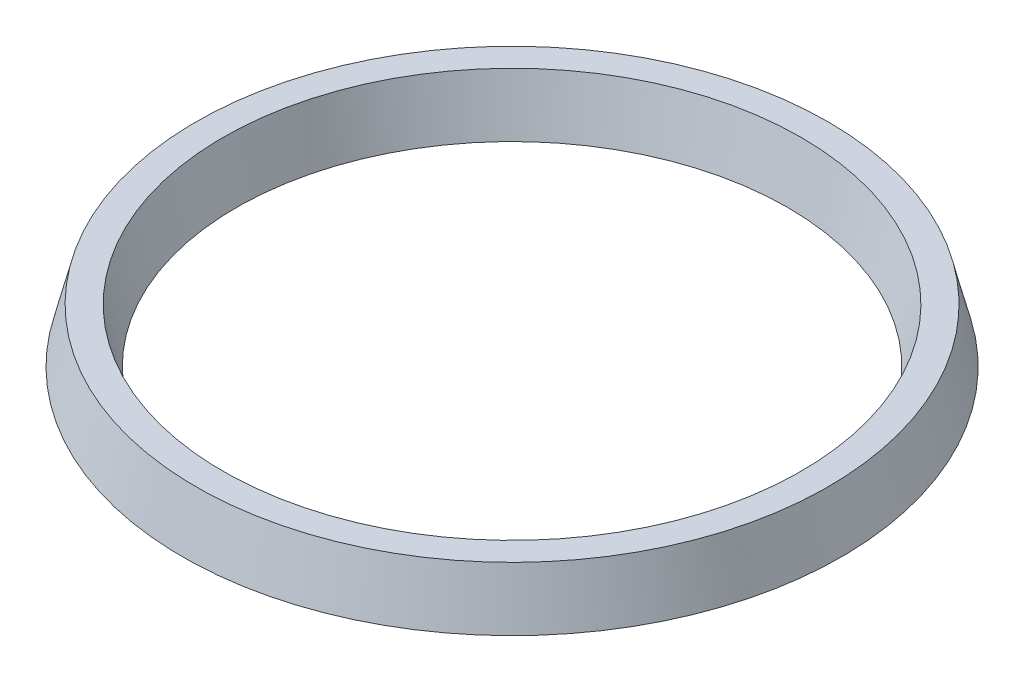
ISO-10303-21;
HEADER;
FILE_DESCRIPTION(('STEP AP214'),'2;1');
FILE_NAME('part.step','',(''),(''),'','','');
FILE_SCHEMA(('AUTOMOTIVE_DESIGN { 1 0 10303 214 1 1 1 1 }'));
ENDSEC;
DATA;
#1=APPLICATION_CONTEXT('core data for automotive mechanical design processes');
#2=APPLICATION_PROTOCOL_DEFINITION('international standard','automotive_design',2000,#1);
#3=PRODUCT_CONTEXT('',#1,'mechanical');
#4=PRODUCT('Part','Part','',(#3));
#5=PRODUCT_RELATED_PRODUCT_CATEGORY('part','',(#4));
#6=PRODUCT_DEFINITION_FORMATION('','',#4);
#7=PRODUCT_DEFINITION_CONTEXT('part definition',#1,'design');
#8=PRODUCT_DEFINITION('design','',#6,#7);
#9=PRODUCT_DEFINITION_SHAPE('','',#8);
#10=(LENGTH_UNIT() NAMED_UNIT(*) SI_UNIT(.MILLI.,.METRE.));
#11=(NAMED_UNIT(*) PLANE_ANGLE_UNIT() SI_UNIT($,.RADIAN.));
#12=(NAMED_UNIT(*) SI_UNIT($,.STERADIAN.) SOLID_ANGLE_UNIT());
#13=UNCERTAINTY_MEASURE_WITH_UNIT(LENGTH_MEASURE(1.E-05),#10,'distance_accuracy_value','');
#14=(GEOMETRIC_REPRESENTATION_CONTEXT(3) GLOBAL_UNCERTAINTY_ASSIGNED_CONTEXT((#13)) GLOBAL_UNIT_ASSIGNED_CONTEXT((#10,
#11,#12)) REPRESENTATION_CONTEXT('',''));
#15=CARTESIAN_POINT('',(0.,0.,0.));
#16=DIRECTION('',(0.,0.,1.));
#17=DIRECTION('',(1.,0.,0.));
#18=AXIS2_PLACEMENT_3D('',#15,#16,#17);
#19=CARTESIAN_POINT('',(0.,6.00000000000001,0.));
#20=DIRECTION('',(0.,1.,0.));
#21=DIRECTION('',(0.,0.,1.));
#22=AXIS2_PLACEMENT_3D('',#19,#20,#21);
#23=CONICAL_SURFACE('',#22,64.31,0.244978663126864);
#24=CARTESIAN_POINT('',(0.,-5.99999999999999,0.));
#25=DIRECTION('',(0.,-1.,0.));
#26=DIRECTION('',(0.,0.,-1.));
#27=AXIS2_PLACEMENT_3D('',#24,#25,#26);
#28=CIRCLE('',#27,61.31);
#29=CARTESIAN_POINT('',(0.,-5.99999999999999,-61.31));
#30=VERTEX_POINT('',#29);
#31=EDGE_CURVE('E59',#30,#30,#28,.T.);
#32=ORIENTED_EDGE('',*,*,#31,.T.);
#33=EDGE_LOOP('',(#32));
#34=FACE_BOUND('',#33,.T.);
#35=CARTESIAN_POINT('',(0.,6.00000000000001,0.));
#36=DIRECTION('',(0.,-1.,0.));
#37=DIRECTION('',(0.,0.,-1.));
#38=AXIS2_PLACEMENT_3D('',#35,#36,#37);
#39=CIRCLE('',#38,64.31);
#40=CARTESIAN_POINT('',(0.,6.00000000000001,-64.31));
#41=VERTEX_POINT('',#40);
#42=EDGE_CURVE('E10',#41,#41,#39,.T.);
#43=ORIENTED_EDGE('',*,*,#42,.F.);
#44=EDGE_LOOP('',(#43));
#45=FACE_BOUND('',#44,.T.);
#46=ADVANCED_FACE('F31',(#34,#45),#23,.F.);
#47=CARTESIAN_POINT('',(0.,6.00000000000001,-64.31));
#48=DIRECTION('',(0.,1.,0.));
#49=DIRECTION('',(0.,0.,1.));
#50=AXIS2_PLACEMENT_3D('',#47,#48,#49);
#51=PLANE('',#50);
#52=ORIENTED_EDGE('',*,*,#42,.T.);
#53=EDGE_LOOP('',(#52));
#54=FACE_BOUND('',#53,.T.);
#55=CARTESIAN_POINT('',(0.,6.00000000000001,0.));
#56=DIRECTION('',(0.,-1.,0.));
#57=DIRECTION('',(0.,0.,-1.));
#58=AXIS2_PLACEMENT_3D('',#55,#56,#57);
#59=CIRCLE('',#58,70.31);
#60=CARTESIAN_POINT('',(0.,6.00000000000001,-70.31));
#61=VERTEX_POINT('',#60);
#62=EDGE_CURVE('E37',#61,#61,#59,.T.);
#63=ORIENTED_EDGE('',*,*,#62,.F.);
#64=EDGE_LOOP('',(#63));
#65=FACE_BOUND('',#64,.T.);
#66=ADVANCED_FACE('F77',(#54,#65),#51,.T.);
#67=CARTESIAN_POINT('',(0.,-5.99999999999999,0.));
#68=DIRECTION('',(0.,-1.,0.));
#69=DIRECTION('',(0.,0.,-1.));
#70=AXIS2_PLACEMENT_3D('',#67,#68,#69);
#71=CONICAL_SURFACE('',#70,73.31,0.244978663126864);
#72=ORIENTED_EDGE('',*,*,#62,.T.);
#73=EDGE_LOOP('',(#72));
#74=FACE_BOUND('',#73,.T.);
#75=CARTESIAN_POINT('',(0.,-5.99999999999999,0.));
#76=DIRECTION('',(0.,-1.,0.));
#77=DIRECTION('',(0.,0.,-1.));
#78=AXIS2_PLACEMENT_3D('',#75,#76,#77);
#79=CIRCLE('',#78,73.31);
#80=CARTESIAN_POINT('',(0.,-5.99999999999999,-73.31));
#81=VERTEX_POINT('',#80);
#82=EDGE_CURVE('E41',#81,#81,#79,.T.);
#83=ORIENTED_EDGE('',*,*,#82,.F.);
#84=EDGE_LOOP('',(#83));
#85=FACE_BOUND('',#84,.T.);
#86=ADVANCED_FACE('F81',(#74,#85),#71,.T.);
#87=CARTESIAN_POINT('',(0.,-5.99999999999999,-73.31));
#88=DIRECTION('',(0.,-1.,0.));
#89=DIRECTION('',(0.,0.,-1.));
#90=AXIS2_PLACEMENT_3D('',#87,#88,#89);
#91=PLANE('',#90);
#92=ORIENTED_EDGE('',*,*,#82,.T.);
#93=EDGE_LOOP('',(#92));
#94=FACE_BOUND('',#93,.T.);
#95=CARTESIAN_POINT('',(0.,-5.99999999999999,0.));
#96=DIRECTION('',(0.,-1.,0.));
#97=DIRECTION('',(0.,0.,-1.));
#98=AXIS2_PLACEMENT_3D('',#95,#96,#97);
#99=CIRCLE('',#98,70.31);
#100=CARTESIAN_POINT('',(0.,-5.99999999999999,-70.31));
#101=VERTEX_POINT('',#100);
#102=EDGE_CURVE('E45',#101,#101,#99,.T.);
#103=ORIENTED_EDGE('',*,*,#102,.F.);
#104=EDGE_LOOP('',(#103));
#105=FACE_BOUND('',#104,.T.);
#106=ADVANCED_FACE('F85',(#94,#105),#91,.T.);
#107=CARTESIAN_POINT('',(0.,-1.45521375021798,0.));
#108=DIRECTION('',(0.,-1.,0.));
#109=DIRECTION('',(0.,0.,-1.));
#110=AXIS2_PLACEMENT_3D('',#107,#108,#109);
#111=CONICAL_SURFACE('',#110,69.1738034375545,0.244978663126869);
#112=ORIENTED_EDGE('',*,*,#102,.T.);
#113=EDGE_LOOP('',(#112));
#114=FACE_BOUND('',#113,.T.);
#115=CARTESIAN_POINT('',(0.,-1.45521375021798,0.));
#116=DIRECTION('',(0.,-1.,0.));
#117=DIRECTION('',(0.,0.,-1.));
#118=AXIS2_PLACEMENT_3D('',#115,#116,#117);
#119=CIRCLE('',#118,69.1738034375545);
#120=CARTESIAN_POINT('',(0.,-1.45521375021798,-69.1738034375545));
#121=VERTEX_POINT('',#120);
#122=EDGE_CURVE('E50',#121,#121,#119,.T.);
#123=ORIENTED_EDGE('',*,*,#122,.F.);
#124=EDGE_LOOP('',(#123));
#125=FACE_BOUND('',#124,.T.);
#126=ADVANCED_FACE('F91',(#114,#125),#111,.F.);
#127=CARTESIAN_POINT('',(0.,-1.9211646096066,0.));
#128=DIRECTION('',(0.,-1.,0.));
#129=DIRECTION('',(0.,0.,-1.));
#130=AXIS2_PLACEMENT_3D('',#127,#128,#129);
#131=TOROIDAL_SURFACE('',#130,67.31,1.9211646096066);
#132=ORIENTED_EDGE('',*,*,#122,.T.);
#133=EDGE_LOOP('',(#132));
#134=FACE_BOUND('',#133,.T.);
#135=CARTESIAN_POINT('',(0.,-1.45521375021798,0.));
#136=DIRECTION('',(0.,-1.,0.));
#137=DIRECTION('',(0.,0.,-1.));
#138=AXIS2_PLACEMENT_3D('',#135,#136,#137);
#139=CIRCLE('',#138,65.4461965624455);
#140=CARTESIAN_POINT('',(0.,-1.45521375021798,-65.4461965624455));
#141=VERTEX_POINT('',#140);
#142=EDGE_CURVE('E53',#141,#141,#139,.T.);
#143=ORIENTED_EDGE('',*,*,#142,.F.);
#144=EDGE_LOOP('',(#143));
#145=FACE_BOUND('',#144,.T.);
#146=ADVANCED_FACE('F73',(#134,#145),#131,.F.);
#147=CARTESIAN_POINT('',(0.,-5.99999999999999,0.));
#148=DIRECTION('',(0.,1.,0.));
#149=DIRECTION('',(0.,0.,1.));
#150=AXIS2_PLACEMENT_3D('',#147,#148,#149);
#151=CONICAL_SURFACE('',#150,64.31,0.244978663126869);
#152=ORIENTED_EDGE('',*,*,#142,.T.);
#153=EDGE_LOOP('',(#152));
#154=FACE_BOUND('',#153,.T.);
#155=CARTESIAN_POINT('',(0.,-5.99999999999999,0.));
#156=DIRECTION('',(0.,-1.,0.));
#157=DIRECTION('',(0.,0.,-1.));
#158=AXIS2_PLACEMENT_3D('',#155,#156,#157);
#159=CIRCLE('',#158,64.31);
#160=CARTESIAN_POINT('',(0.,-5.99999999999999,-64.31));
#161=VERTEX_POINT('',#160);
#162=EDGE_CURVE('E56',#161,#161,#159,.T.);
#163=ORIENTED_EDGE('',*,*,#162,.F.);
#164=EDGE_LOOP('',(#163));
#165=FACE_BOUND('',#164,.T.);
#166=ADVANCED_FACE('F67',(#154,#165),#151,.T.);
#167=CARTESIAN_POINT('',(0.,-5.99999999999999,-61.31));
#168=DIRECTION('',(0.,-1.,0.));
#169=DIRECTION('',(0.,0.,-1.));
#170=AXIS2_PLACEMENT_3D('',#167,#168,#169);
#171=PLANE('',#170);
#172=ORIENTED_EDGE('',*,*,#162,.T.);
#173=EDGE_LOOP('',(#172));
#174=FACE_BOUND('',#173,.T.);
#175=ORIENTED_EDGE('',*,*,#31,.F.);
#176=EDGE_LOOP('',(#175));
#177=FACE_BOUND('',#176,.T.);
#178=ADVANCED_FACE('F65',(#174,#177),#171,.T.);
#179=CLOSED_SHELL('',(#46,#66,#86,#106,#126,#146,#166,#178));
#180=MANIFOLD_SOLID_BREP('B2',#179);
#181=ADVANCED_BREP_SHAPE_REPRESENTATION('',(#18,#180),#14);
#182=SHAPE_DEFINITION_REPRESENTATION(#9,#181);
ENDSEC;
END-ISO-10303-21;
